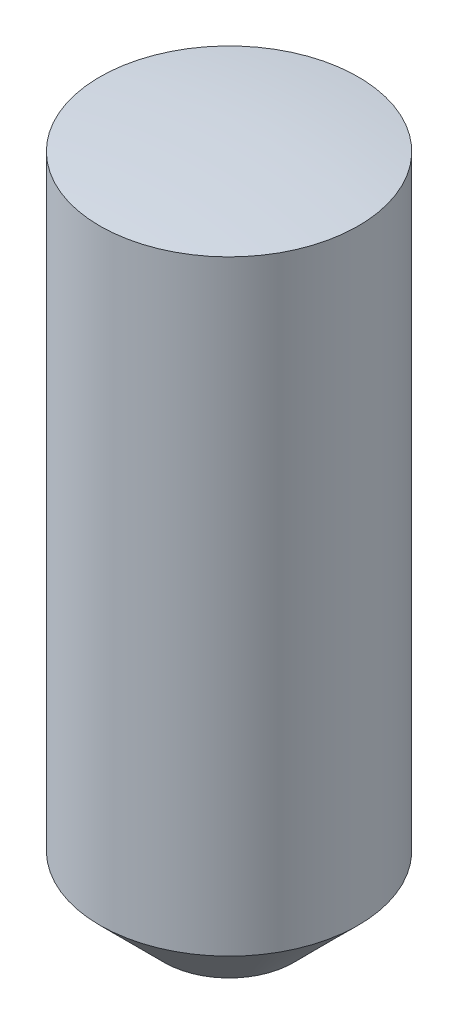
ISO-10303-21;
HEADER;
FILE_DESCRIPTION(('STEP AP214'),'2;1');
FILE_NAME('part.step','',(''),(''),'','','');
FILE_SCHEMA(('AUTOMOTIVE_DESIGN { 1 0 10303 214 1 1 1 1 }'));
ENDSEC;
DATA;
#1=APPLICATION_CONTEXT('core data for automotive mechanical design processes');
#2=APPLICATION_PROTOCOL_DEFINITION('international standard','automotive_design',2000,#1);
#3=PRODUCT_CONTEXT('',#1,'mechanical');
#4=PRODUCT('Part','Part','',(#3));
#5=PRODUCT_RELATED_PRODUCT_CATEGORY('part','',(#4));
#6=PRODUCT_DEFINITION_FORMATION('','',#4);
#7=PRODUCT_DEFINITION_CONTEXT('part definition',#1,'design');
#8=PRODUCT_DEFINITION('design','',#6,#7);
#9=PRODUCT_DEFINITION_SHAPE('','',#8);
#10=(LENGTH_UNIT() NAMED_UNIT(*) SI_UNIT(.MILLI.,.METRE.));
#11=(NAMED_UNIT(*) PLANE_ANGLE_UNIT() SI_UNIT($,.RADIAN.));
#12=(NAMED_UNIT(*) SI_UNIT($,.STERADIAN.) SOLID_ANGLE_UNIT());
#13=UNCERTAINTY_MEASURE_WITH_UNIT(LENGTH_MEASURE(1.E-05),#10,'distance_accuracy_value','');
#14=(GEOMETRIC_REPRESENTATION_CONTEXT(3) GLOBAL_UNCERTAINTY_ASSIGNED_CONTEXT((#13)) GLOBAL_UNIT_ASSIGNED_CONTEXT((#10,
#11,#12)) REPRESENTATION_CONTEXT('',''));
#15=CARTESIAN_POINT('',(0.,0.,0.));
#16=DIRECTION('',(0.,0.,1.));
#17=DIRECTION('',(1.,0.,0.));
#18=AXIS2_PLACEMENT_3D('',#15,#16,#17);
#19=CARTESIAN_POINT('',(0.,-5.25,0.));
#20=DIRECTION('',(0.,1.,0.));
#21=DIRECTION('',(0.,0.,1.));
#22=AXIS2_PLACEMENT_3D('',#19,#20,#21);
#23=PLANE('',#22);
#24=CARTESIAN_POINT('',(0.,-5.24999999998954,0.));
#25=DIRECTION('',(0.,1.,0.));
#26=DIRECTION('',(0.,0.,1.));
#27=AXIS2_PLACEMENT_3D('',#24,#25,#26);
#28=CIRCLE('',#27,0.499999999988177);
#29=CARTESIAN_POINT('',(0.,-5.24999999998954,0.499999999988177));
#30=VERTEX_POINT('',#29);
#31=EDGE_CURVE('E18',#30,#30,#28,.T.);
#32=ORIENTED_EDGE('',*,*,#31,.F.);
#33=EDGE_LOOP('',(#32));
#34=FACE_BOUND('',#33,.T.);
#35=ADVANCED_FACE('F15',(#34),#23,.F.);
#36=CARTESIAN_POINT('',(0.,-4.75000000000136,0.));
#37=DIRECTION('',(0.,1.,0.));
#38=DIRECTION('',(0.,0.,1.));
#39=AXIS2_PLACEMENT_3D('',#36,#37,#38);
#40=CONICAL_SURFACE('',#39,0.999999999976353,0.785398163397448);
#41=CARTESIAN_POINT('',(0.,-4.75,0.));
#42=DIRECTION('',(0.,1.,0.));
#43=DIRECTION('',(0.,0.,1.));
#44=AXIS2_PLACEMENT_3D('',#41,#42,#43);
#45=CIRCLE('',#44,1.);
#46=CARTESIAN_POINT('',(0.,-4.75,1.));
#47=VERTEX_POINT('',#46);
#48=EDGE_CURVE('E22',#47,#47,#45,.T.);
#49=ORIENTED_EDGE('',*,*,#48,.F.);
#50=EDGE_LOOP('',(#49));
#51=FACE_BOUND('',#50,.T.);
#52=ORIENTED_EDGE('',*,*,#31,.T.);
#53=EDGE_LOOP('',(#52));
#54=FACE_BOUND('',#53,.T.);
#55=ADVANCED_FACE('F34',(#51,#54),#40,.T.);
#56=CARTESIAN_POINT('',(0.,-8.,0.));
#57=DIRECTION('',(-1.,0.,0.));
#58=DIRECTION('',(0.,1.,0.));
#59=AXIS2_PLACEMENT_3D('',#56,#57,#58);
#60=SPHERICAL_SURFACE('',#59,8.);
#61=CARTESIAN_POINT('',(0.,-0.0627460668062296,0.));
#62=DIRECTION('',(0.,1.,0.));
#63=DIRECTION('',(0.,0.,1.));
#64=AXIS2_PLACEMENT_3D('',#61,#62,#63);
#65=CIRCLE('',#64,1.);
#66=CARTESIAN_POINT('',(0.,-0.0627460668062296,1.));
#67=VERTEX_POINT('',#66);
#68=EDGE_CURVE('E10',#67,#67,#65,.F.);
#69=ORIENTED_EDGE('',*,*,#68,.F.);
#70=EDGE_LOOP('',(#69));
#71=FACE_BOUND('',#70,.T.);
#72=ADVANCED_FACE('F30',(#71),#60,.T.);
#73=CARTESIAN_POINT('',(0.,-5.25,0.));
#74=DIRECTION('',(0.,1.,0.));
#75=DIRECTION('',(0.,0.,1.));
#76=AXIS2_PLACEMENT_3D('',#73,#74,#75);
#77=CYLINDRICAL_SURFACE('',#76,1.);
#78=ORIENTED_EDGE('',*,*,#68,.T.);
#79=EDGE_LOOP('',(#78));
#80=FACE_BOUND('',#79,.T.);
#81=ORIENTED_EDGE('',*,*,#48,.T.);
#82=EDGE_LOOP('',(#81));
#83=FACE_BOUND('',#82,.T.);
#84=ADVANCED_FACE('F33',(#80,#83),#77,.T.);
#85=CLOSED_SHELL('',(#35,#55,#72,#84));
#86=MANIFOLD_SOLID_BREP('B1',#85);
#87=ADVANCED_BREP_SHAPE_REPRESENTATION('',(#18,#86),#14);
#88=SHAPE_DEFINITION_REPRESENTATION(#9,#87);
ENDSEC;
END-ISO-10303-21;
